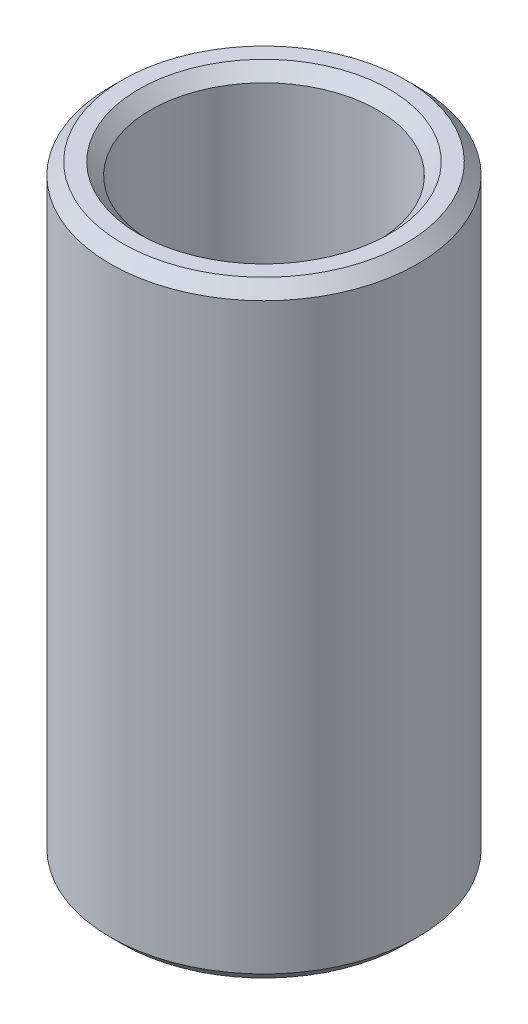
ISO-10303-21;
HEADER;
FILE_DESCRIPTION(('STEP AP214'),'2;1');
FILE_NAME('part.step','',(''),(''),'','','');
FILE_SCHEMA(('AUTOMOTIVE_DESIGN { 1 0 10303 214 1 1 1 1 }'));
ENDSEC;
DATA;
#1=APPLICATION_CONTEXT('core data for automotive mechanical design processes');
#2=APPLICATION_PROTOCOL_DEFINITION('international standard','automotive_design',2000,#1);
#3=PRODUCT_CONTEXT('',#1,'mechanical');
#4=PRODUCT('Part','Part','',(#3));
#5=PRODUCT_RELATED_PRODUCT_CATEGORY('part','',(#4));
#6=PRODUCT_DEFINITION_FORMATION('','',#4);
#7=PRODUCT_DEFINITION_CONTEXT('part definition',#1,'design');
#8=PRODUCT_DEFINITION('design','',#6,#7);
#9=PRODUCT_DEFINITION_SHAPE('','',#8);
#10=(LENGTH_UNIT() NAMED_UNIT(*) SI_UNIT(.MILLI.,.METRE.));
#11=(NAMED_UNIT(*) PLANE_ANGLE_UNIT() SI_UNIT($,.RADIAN.));
#12=(NAMED_UNIT(*) SI_UNIT($,.STERADIAN.) SOLID_ANGLE_UNIT());
#13=UNCERTAINTY_MEASURE_WITH_UNIT(LENGTH_MEASURE(1.E-05),#10,'distance_accuracy_value','');
#14=(GEOMETRIC_REPRESENTATION_CONTEXT(3) GLOBAL_UNCERTAINTY_ASSIGNED_CONTEXT((#13)) GLOBAL_UNIT_ASSIGNED_CONTEXT((#10,
#11,#12)) REPRESENTATION_CONTEXT('',''));
#15=CARTESIAN_POINT('',(0.,0.,0.));
#16=DIRECTION('',(0.,0.,1.));
#17=DIRECTION('',(1.,0.,0.));
#18=AXIS2_PLACEMENT_3D('',#15,#16,#17);
#19=CARTESIAN_POINT('',(0.,167.971312469426,0.));
#20=DIRECTION('',(0.,-1.,0.));
#21=DIRECTION('',(0.,0.,-1.));
#22=AXIS2_PLACEMENT_3D('',#19,#20,#21);
#23=CYLINDRICAL_SURFACE('',#22,42.5);
#24=CARTESIAN_POINT('',(0.,3.29927583885564,0.));
#25=DIRECTION('',(0.,1.,0.));
#26=DIRECTION('',(0.,0.,1.));
#27=AXIS2_PLACEMENT_3D('',#24,#25,#26);
#28=CIRCLE('',#27,42.5);
#29=CARTESIAN_POINT('',(0.,3.29927583885564,42.5));
#30=VERTEX_POINT('',#29);
#31=EDGE_CURVE('E10',#30,#30,#28,.T.);
#32=ORIENTED_EDGE('',*,*,#31,.T.);
#33=EDGE_LOOP('',(#32));
#34=FACE_BOUND('',#33,.T.);
#35=CARTESIAN_POINT('',(0.,164.67203663057,0.));
#36=DIRECTION('',(0.,1.,0.));
#37=DIRECTION('',(0.,0.,1.));
#38=AXIS2_PLACEMENT_3D('',#35,#36,#37);
#39=CIRCLE('',#38,42.5);
#40=CARTESIAN_POINT('',(0.,164.67203663057,42.5));
#41=VERTEX_POINT('',#40);
#42=EDGE_CURVE('E50',#41,#41,#39,.F.);
#43=ORIENTED_EDGE('',*,*,#42,.T.);
#44=EDGE_LOOP('',(#43));
#45=FACE_BOUND('',#44,.T.);
#46=ADVANCED_FACE('F39',(#34,#45),#23,.T.);
#47=CARTESIAN_POINT('',(0.,167.971312469426,0.));
#48=DIRECTION('',(0.,1.,0.));
#49=DIRECTION('',(0.,0.,1.));
#50=AXIS2_PLACEMENT_3D('',#47,#48,#49);
#51=PLANE('',#50);
#52=CARTESIAN_POINT('',(0.,167.971312469426,0.));
#53=DIRECTION('',(0.,1.,0.));
#54=DIRECTION('',(0.,0.,1.));
#55=AXIS2_PLACEMENT_3D('',#52,#53,#54);
#56=CIRCLE('',#55,34.6946592955059);
#57=CARTESIAN_POINT('',(0.,167.971312469426,34.6946592955059));
#58=VERTEX_POINT('',#57);
#59=EDGE_CURVE('E58',#58,#58,#56,.F.);
#60=ORIENTED_EDGE('',*,*,#59,.T.);
#61=EDGE_LOOP('',(#60));
#62=FACE_BOUND('',#61,.T.);
#63=CARTESIAN_POINT('',(0.,167.971312469426,0.));
#64=DIRECTION('',(0.,1.,0.));
#65=DIRECTION('',(0.,0.,1.));
#66=AXIS2_PLACEMENT_3D('',#63,#64,#65);
#67=CIRCLE('',#66,39.2007241611444);
#68=CARTESIAN_POINT('',(0.,167.971312469426,39.2007241611444));
#69=VERTEX_POINT('',#68);
#70=EDGE_CURVE('E61',#69,#69,#67,.T.);
#71=ORIENTED_EDGE('',*,*,#70,.T.);
#72=EDGE_LOOP('',(#71));
#73=FACE_BOUND('',#72,.T.);
#74=ADVANCED_FACE('F88',(#62,#73),#51,.T.);
#75=CARTESIAN_POINT('',(0.,0.,0.));
#76=DIRECTION('',(0.,1.,0.));
#77=DIRECTION('',(0.,0.,1.));
#78=AXIS2_PLACEMENT_3D('',#75,#76,#77);
#79=PLANE('',#78);
#80=CARTESIAN_POINT('',(0.,0.,0.));
#81=DIRECTION('',(0.,1.,0.));
#82=DIRECTION('',(0.,0.,1.));
#83=AXIS2_PLACEMENT_3D('',#80,#81,#82);
#84=CIRCLE('',#83,34.694659295506);
#85=CARTESIAN_POINT('',(0.,0.,34.694659295506));
#86=VERTEX_POINT('',#85);
#87=EDGE_CURVE('E51',#86,#86,#84,.T.);
#88=ORIENTED_EDGE('',*,*,#87,.T.);
#89=EDGE_LOOP('',(#88));
#90=FACE_BOUND('',#89,.T.);
#91=CARTESIAN_POINT('',(0.,0.,0.));
#92=DIRECTION('',(0.,1.,0.));
#93=DIRECTION('',(0.,0.,1.));
#94=AXIS2_PLACEMENT_3D('',#91,#92,#93);
#95=CIRCLE('',#94,39.2007241611444);
#96=CARTESIAN_POINT('',(0.,0.,39.2007241611444));
#97=VERTEX_POINT('',#96);
#98=EDGE_CURVE('E54',#97,#97,#95,.F.);
#99=ORIENTED_EDGE('',*,*,#98,.T.);
#100=EDGE_LOOP('',(#99));
#101=FACE_BOUND('',#100,.T.);
#102=ADVANCED_FACE('F83',(#90,#101),#79,.F.);
#103=CARTESIAN_POINT('',(0.,167.971312469426,0.));
#104=DIRECTION('',(0.,-1.,0.));
#105=DIRECTION('',(0.,0.,-1.));
#106=AXIS2_PLACEMENT_3D('',#103,#104,#105);
#107=CYLINDRICAL_SURFACE('',#106,31.3953834566503);
#108=CARTESIAN_POINT('',(0.,164.67203663057,0.));
#109=DIRECTION('',(0.,1.,0.));
#110=DIRECTION('',(0.,0.,1.));
#111=AXIS2_PLACEMENT_3D('',#108,#109,#110);
#112=CIRCLE('',#111,31.3953834566503);
#113=CARTESIAN_POINT('',(0.,164.67203663057,31.3953834566503));
#114=VERTEX_POINT('',#113);
#115=EDGE_CURVE('E67',#114,#114,#112,.T.);
#116=ORIENTED_EDGE('',*,*,#115,.T.);
#117=EDGE_LOOP('',(#116));
#118=FACE_BOUND('',#117,.T.);
#119=CARTESIAN_POINT('',(0.,3.29927583885567,0.));
#120=DIRECTION('',(0.,1.,0.));
#121=DIRECTION('',(0.,0.,1.));
#122=AXIS2_PLACEMENT_3D('',#119,#120,#121);
#123=CIRCLE('',#122,31.3953834566503);
#124=CARTESIAN_POINT('',(0.,3.29927583885567,31.3953834566503));
#125=VERTEX_POINT('',#124);
#126=EDGE_CURVE('E69',#125,#125,#123,.F.);
#127=ORIENTED_EDGE('',*,*,#126,.T.);
#128=EDGE_LOOP('',(#127));
#129=FACE_BOUND('',#128,.T.);
#130=ADVANCED_FACE('F71',(#118,#129),#107,.F.);
#131=CARTESIAN_POINT('',(0.,164.67203663057,0.));
#132=DIRECTION('',(0.,1.,0.));
#133=DIRECTION('',(0.,0.,1.));
#134=AXIS2_PLACEMENT_3D('',#131,#132,#133);
#135=CONICAL_SURFACE('',#134,31.3953834566503,0.785398163397449);
#136=CARTESIAN_POINT('',(0.,167.971312469426,34.6946592955059));
#137=CARTESIAN_POINT('',(0.,167.936945012771,34.6602918388512));
#138=CARTESIAN_POINT('',(0.,167.902577556117,34.6259243821964));
#139=CARTESIAN_POINT('',(0.,167.833842642807,34.5571894688869));
#140=CARTESIAN_POINT('',(0.,167.799475186152,34.5228220122322));
#141=CARTESIAN_POINT('',(0.,167.730740272843,34.4540870989227));
#142=CARTESIAN_POINT('',(0.,167.696372816188,34.419719642268));
#143=CARTESIAN_POINT('',(0.,167.627637902879,34.3509847289585));
#144=CARTESIAN_POINT('',(0.,167.593270446224,34.3166172723037));
#145=CARTESIAN_POINT('',(0.,167.524535532914,34.2478823589942));
#146=CARTESIAN_POINT('',(0.,167.49016807626,34.2135149023395));
#147=CARTESIAN_POINT('',(0.,167.42143316295,34.14477998903));
#148=CARTESIAN_POINT('',(0.,167.387065706295,34.1104125323752));
#149=CARTESIAN_POINT('',(0.,167.318330792986,34.0416776190658));
#150=CARTESIAN_POINT('',(0.,167.283963336331,34.007310162411));
#151=CARTESIAN_POINT('',(0.,167.215228423022,33.9385752491015));
#152=CARTESIAN_POINT('',(0.,167.180860966367,33.9042077924468));
#153=CARTESIAN_POINT('',(0.,167.112126053057,33.8354728791373));
#154=CARTESIAN_POINT('',(0.,167.077758596403,33.8011054224825));
#155=CARTESIAN_POINT('',(0.,167.009023683093,33.732370509173));
#156=CARTESIAN_POINT('',(0.,166.974656226438,33.6980030525183));
#157=CARTESIAN_POINT('',(0.,166.905921313129,33.6292681392088));
#158=CARTESIAN_POINT('',(0.,166.871553856474,33.5949006825541));
#159=CARTESIAN_POINT('',(0.,166.802818943165,33.5261657692446));
#160=CARTESIAN_POINT('',(0.,166.76845148651,33.4917983125898));
#161=CARTESIAN_POINT('',(0.,166.6997165732,33.4230633992803));
#162=CARTESIAN_POINT('',(0.,166.665349116546,33.3886959426256));
#163=CARTESIAN_POINT('',(0.,166.596614203236,33.3199610293161));
#164=CARTESIAN_POINT('',(0.,166.562246746581,33.2855935726613));
#165=CARTESIAN_POINT('',(0.,166.493511833272,33.2168586593518));
#166=CARTESIAN_POINT('',(0.,166.459144376617,33.1824912026971));
#167=CARTESIAN_POINT('',(0.,166.390409463308,33.1137562893876));
#168=CARTESIAN_POINT('',(0.,166.356042006653,33.0793888327329));
#169=CARTESIAN_POINT('',(0.,166.287307093344,33.0106539194234));
#170=CARTESIAN_POINT('',(0.,166.252939636689,32.9762864627686));
#171=CARTESIAN_POINT('',(0.,166.184204723379,32.9075515494591));
#172=CARTESIAN_POINT('',(0.,166.149837266725,32.8731840928044));
#173=CARTESIAN_POINT('',(0.,166.081102353415,32.8044491794949));
#174=CARTESIAN_POINT('',(0.,166.04673489676,32.7700817228401));
#175=CARTESIAN_POINT('',(0.,165.977999983451,32.7013468095307));
#176=CARTESIAN_POINT('',(0.,165.943632526796,32.6669793528759));
#177=CARTESIAN_POINT('',(0.,165.874897613487,32.5982444395664));
#178=CARTESIAN_POINT('',(0.,165.840530156832,32.5638769829117));
#179=CARTESIAN_POINT('',(0.,165.771795243522,32.4951420696022));
#180=CARTESIAN_POINT('',(0.,165.737427786868,32.4607746129474));
#181=CARTESIAN_POINT('',(0.,165.668692873558,32.3920396996379));
#182=CARTESIAN_POINT('',(0.,165.634325416903,32.3576722429832));
#183=CARTESIAN_POINT('',(0.,165.565590503594,32.2889373296737));
#184=CARTESIAN_POINT('',(0.,165.531223046939,32.254569873019));
#185=CARTESIAN_POINT('',(0.,165.46248813363,32.1858349597095));
#186=CARTESIAN_POINT('',(0.,165.428120676975,32.1514675030547));
#187=CARTESIAN_POINT('',(0.,165.359385763665,32.0827325897452));
#188=CARTESIAN_POINT('',(0.,165.325018307011,32.0483651330905));
#189=CARTESIAN_POINT('',(0.,165.256283393701,31.979630219781));
#190=CARTESIAN_POINT('',(0.,165.221915937046,31.9452627631262));
#191=CARTESIAN_POINT('',(0.,165.153181023737,31.8765278498167));
#192=CARTESIAN_POINT('',(0.,165.118813567082,31.842160393162));
#193=CARTESIAN_POINT('',(0.,165.050078653773,31.7734254798525));
#194=CARTESIAN_POINT('',(0.,165.015711197118,31.7390580231978));
#195=CARTESIAN_POINT('',(0.,164.946976283808,31.6703231098883));
#196=CARTESIAN_POINT('',(0.,164.912608827154,31.6359556532335));
#197=CARTESIAN_POINT('',(0.,164.843873913844,31.567220739924));
#198=CARTESIAN_POINT('',(0.,164.809506457189,31.5328532832693));
#199=CARTESIAN_POINT('',(0.,164.74077154388,31.4641183699598));
#200=CARTESIAN_POINT('',(0.,164.706404087225,31.4297509133051));
#201=CARTESIAN_POINT('',(0.,164.67203663057,31.3953834566503));
#202=B_SPLINE_CURVE_WITH_KNOTS('',3,(#136,#137,#138,#139,#140,#141,#142,#143,#144,#145,#146,
#147,#148,#149,#150,#151,#152,#153,#154,#155,#156,#157,#158,#159,#160,#161,#162,#163,#164,#165,
#166,#167,#168,#169,#170,#171,#172,#173,#174,#175,#176,#177,#178,#179,#180,#181,#182,#183,#184,
#185,#186,#187,#188,#189,#190,#191,#192,#193,#194,#195,#196,#197,#198,#199,#200,#201),
.UNSPECIFIED.,.F.,.F.,(4,2,2,2,2,2,2,2,2,2,2,2,2,2,2,2,2,2,2,2,2,2,2,2,2,2,2,2,2,2,2,2,4),(0.,
0.145808769916223,0.29161753983246,0.437426309748683,0.583235079664925,0.729043849581163,
0.874852619497385,1.02066138941363,1.16647015932987,1.31227892924609,1.45808769916233,
1.60389646907857,1.74970523899479,1.89551400891103,2.04132277882727,2.18713154874349,
2.33294031865973,2.47874908857597,2.62455785849219,2.77036662840843,2.91617539832467,
3.0619841682409,3.20779293815713,3.35360170807338,3.4994104779896,3.64521924790584,
3.79102801782208,3.9368367877383,4.08264555765454,4.22845432757078,4.374263097487,
4.52007186740324,4.66588063731946),.UNSPECIFIED.);
#203=EDGE_CURVE('BSEAM77',#58,#114,#202,.T.);
#204=ORIENTED_EDGE('',*,*,#59,.F.);
#205=ORIENTED_EDGE('',*,*,#115,.F.);
#206=ORIENTED_EDGE('',*,*,#203,.T.);
#207=ORIENTED_EDGE('',*,*,#203,.F.);
#208=EDGE_LOOP('',(#204,#206,#205,#207));
#209=FACE_BOUND('',#208,.T.);
#210=ADVANCED_FACE('F77',(#209),#135,.F.);
#211=CARTESIAN_POINT('',(0.,0.,0.));
#212=DIRECTION('',(0.,-1.,0.));
#213=DIRECTION('',(0.,0.,-1.));
#214=AXIS2_PLACEMENT_3D('',#211,#212,#213);
#215=CONICAL_SURFACE('',#214,34.694659295506,0.785398163397445);
#216=ORIENTED_EDGE('',*,*,#126,.F.);
#217=EDGE_LOOP('',(#216));
#218=FACE_BOUND('',#217,.T.);
#219=ORIENTED_EDGE('',*,*,#87,.F.);
#220=EDGE_LOOP('',(#219));
#221=FACE_BOUND('',#220,.T.);
#222=ADVANCED_FACE('F73',(#218,#221),#215,.F.);
#223=CARTESIAN_POINT('',(0.,3.29927583885564,0.));
#224=DIRECTION('',(0.,1.,0.));
#225=DIRECTION('',(0.,0.,1.));
#226=AXIS2_PLACEMENT_3D('',#223,#224,#225);
#227=CONICAL_SURFACE('',#226,42.5,0.78539816339745);
#228=ORIENTED_EDGE('',*,*,#98,.F.);
#229=EDGE_LOOP('',(#228));
#230=FACE_BOUND('',#229,.T.);
#231=ORIENTED_EDGE('',*,*,#31,.F.);
#232=EDGE_LOOP('',(#231));
#233=FACE_BOUND('',#232,.T.);
#234=ADVANCED_FACE('F76',(#230,#233),#227,.T.);
#235=CARTESIAN_POINT('',(0.,167.971312469426,0.));
#236=DIRECTION('',(0.,-1.,0.));
#237=DIRECTION('',(0.,0.,-1.));
#238=AXIS2_PLACEMENT_3D('',#235,#236,#237);
#239=CONICAL_SURFACE('',#238,39.2007241611444,0.785398163397448);
#240=ORIENTED_EDGE('',*,*,#42,.F.);
#241=EDGE_LOOP('',(#240));
#242=FACE_BOUND('',#241,.T.);
#243=ORIENTED_EDGE('',*,*,#70,.F.);
#244=EDGE_LOOP('',(#243));
#245=FACE_BOUND('',#244,.T.);
#246=ADVANCED_FACE('F45',(#242,#245),#239,.T.);
#247=CLOSED_SHELL('',(#46,#74,#102,#130,#210,#222,#234,#246));
#248=MANIFOLD_SOLID_BREP('B2',#247);
#249=ADVANCED_BREP_SHAPE_REPRESENTATION('',(#18,#248),#14);
#250=SHAPE_DEFINITION_REPRESENTATION(#9,#249);
ENDSEC;
END-ISO-10303-21;
